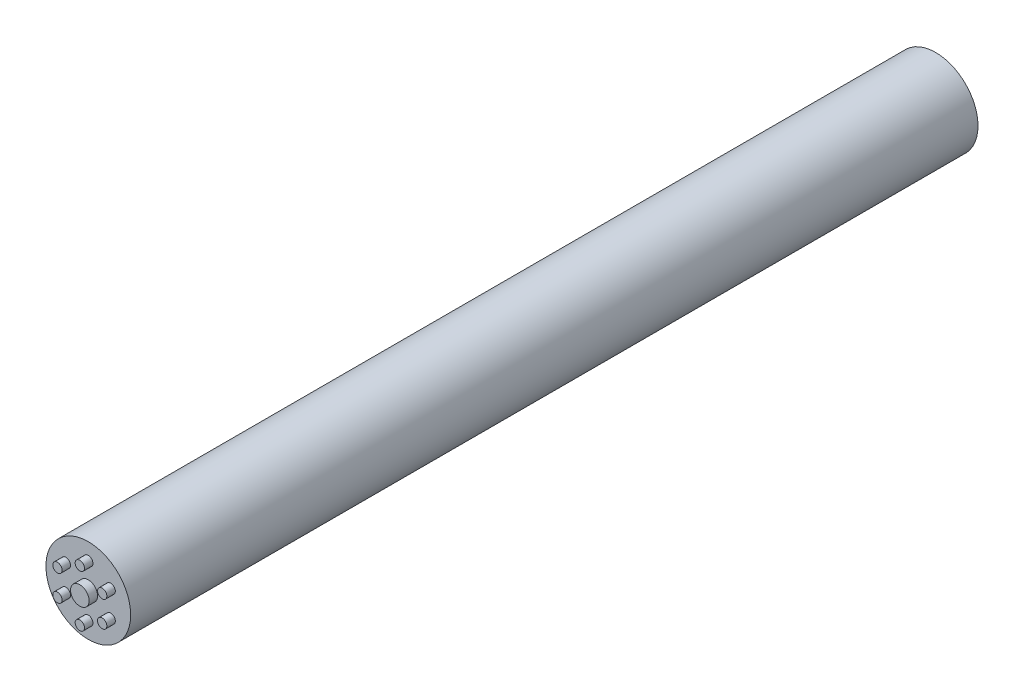
ISO-10303-21;
HEADER;
FILE_DESCRIPTION(('STEP AP214'),'2;1');
FILE_NAME('part.step','',(''),(''),'','','');
FILE_SCHEMA(('AUTOMOTIVE_DESIGN { 1 0 10303 214 1 1 1 1 }'));
ENDSEC;
DATA;
#1=APPLICATION_CONTEXT('core data for automotive mechanical design processes');
#2=APPLICATION_PROTOCOL_DEFINITION('international standard','automotive_design',2000,#1);
#3=PRODUCT_CONTEXT('',#1,'mechanical');
#4=PRODUCT('Part','Part','',(#3));
#5=PRODUCT_RELATED_PRODUCT_CATEGORY('part','',(#4));
#6=PRODUCT_DEFINITION_FORMATION('','',#4);
#7=PRODUCT_DEFINITION_CONTEXT('part definition',#1,'design');
#8=PRODUCT_DEFINITION('design','',#6,#7);
#9=PRODUCT_DEFINITION_SHAPE('','',#8);
#10=(LENGTH_UNIT() NAMED_UNIT(*) SI_UNIT(.MILLI.,.METRE.));
#11=(NAMED_UNIT(*) PLANE_ANGLE_UNIT() SI_UNIT($,.RADIAN.));
#12=(NAMED_UNIT(*) SI_UNIT($,.STERADIAN.) SOLID_ANGLE_UNIT());
#13=UNCERTAINTY_MEASURE_WITH_UNIT(LENGTH_MEASURE(1.E-05),#10,'distance_accuracy_value','');
#14=(GEOMETRIC_REPRESENTATION_CONTEXT(3) GLOBAL_UNCERTAINTY_ASSIGNED_CONTEXT((#13)) GLOBAL_UNIT_ASSIGNED_CONTEXT((#10,
#11,#12)) REPRESENTATION_CONTEXT('',''));
#15=CARTESIAN_POINT('',(0.,0.,0.));
#16=DIRECTION('',(0.,0.,1.));
#17=DIRECTION('',(1.,0.,0.));
#18=AXIS2_PLACEMENT_3D('',#15,#16,#17);
#19=CARTESIAN_POINT('',(0.,0.,100.));
#20=DIRECTION('',(0.,0.,-1.));
#21=DIRECTION('',(-1.,0.,0.));
#22=AXIS2_PLACEMENT_3D('',#19,#20,#21);
#23=CYLINDRICAL_SURFACE('',#22,5.);
#24=CARTESIAN_POINT('',(0.,0.,100.));
#25=DIRECTION('',(0.,0.,1.));
#26=DIRECTION('',(1.,0.,0.));
#27=AXIS2_PLACEMENT_3D('',#24,#25,#26);
#28=CIRCLE('',#27,5.);
#29=CARTESIAN_POINT('',(5.,0.,100.));
#30=VERTEX_POINT('',#29);
#31=EDGE_CURVE('E41',#30,#30,#28,.T.);
#32=ORIENTED_EDGE('',*,*,#31,.F.);
#33=EDGE_LOOP('',(#32));
#34=FACE_BOUND('',#33,.T.);
#35=CARTESIAN_POINT('',(0.,0.,0.));
#36=DIRECTION('',(0.,0.,1.));
#37=DIRECTION('',(1.,0.,0.));
#38=AXIS2_PLACEMENT_3D('',#35,#36,#37);
#39=CIRCLE('',#38,5.);
#40=CARTESIAN_POINT('',(5.,0.,0.));
#41=VERTEX_POINT('',#40);
#42=EDGE_CURVE('E37',#41,#41,#39,.T.);
#43=ORIENTED_EDGE('',*,*,#42,.T.);
#44=EDGE_LOOP('',(#43));
#45=FACE_BOUND('',#44,.T.);
#46=ADVANCED_FACE('F34',(#34,#45),#23,.T.);
#47=CARTESIAN_POINT('',(0.,0.,100.));
#48=DIRECTION('',(0.,0.,1.));
#49=DIRECTION('',(1.,0.,0.));
#50=AXIS2_PLACEMENT_3D('',#47,#48,#49);
#51=PLANE('',#50);
#52=CARTESIAN_POINT('',(0.,3.05097322315044,100.));
#53=DIRECTION('',(0.,0.,1.));
#54=DIRECTION('',(1.,0.,0.));
#55=AXIS2_PLACEMENT_3D('',#52,#53,#54);
#56=CIRCLE('',#55,0.55);
#57=CARTESIAN_POINT('',(0.55,3.05097322315044,100.));
#58=VERTEX_POINT('',#57);
#59=EDGE_CURVE('E78',#58,#58,#56,.T.);
#60=ORIENTED_EDGE('',*,*,#59,.F.);
#61=EDGE_LOOP('',(#60));
#62=FACE_BOUND('',#61,.T.);
#63=CARTESIAN_POINT('',(-2.64222031751437,1.52548661157521,100.));
#64=DIRECTION('',(0.,0.,1.));
#65=DIRECTION('',(1.,0.,0.));
#66=AXIS2_PLACEMENT_3D('',#63,#64,#65);
#67=CIRCLE('',#66,0.55);
#68=CARTESIAN_POINT('',(-2.09222031751437,1.52548661157521,100.));
#69=VERTEX_POINT('',#68);
#70=EDGE_CURVE('E72',#69,#69,#67,.T.);
#71=ORIENTED_EDGE('',*,*,#70,.F.);
#72=EDGE_LOOP('',(#71));
#73=FACE_BOUND('',#72,.T.);
#74=CARTESIAN_POINT('',(-2.64222031751436,-1.52548661157523,100.));
#75=DIRECTION('',(0.,0.,1.));
#76=DIRECTION('',(1.,0.,0.));
#77=AXIS2_PLACEMENT_3D('',#74,#75,#76);
#78=CIRCLE('',#77,0.55);
#79=CARTESIAN_POINT('',(-2.09222031751436,-1.52548661157523,100.));
#80=VERTEX_POINT('',#79);
#81=EDGE_CURVE('E66',#80,#80,#78,.T.);
#82=ORIENTED_EDGE('',*,*,#81,.F.);
#83=EDGE_LOOP('',(#82));
#84=FACE_BOUND('',#83,.T.);
#85=CARTESIAN_POINT('',(0.,-3.05097322315044,100.));
#86=DIRECTION('',(0.,0.,1.));
#87=DIRECTION('',(1.,0.,0.));
#88=AXIS2_PLACEMENT_3D('',#85,#86,#87);
#89=CIRCLE('',#88,0.55);
#90=CARTESIAN_POINT('',(0.550000000000021,-3.05097322315044,100.));
#91=VERTEX_POINT('',#90);
#92=EDGE_CURVE('E60',#91,#91,#89,.T.);
#93=ORIENTED_EDGE('',*,*,#92,.F.);
#94=EDGE_LOOP('',(#93));
#95=FACE_BOUND('',#94,.T.);
#96=CARTESIAN_POINT('',(2.64222031751438,-1.52548661157519,100.));
#97=DIRECTION('',(0.,0.,1.));
#98=DIRECTION('',(1.,0.,0.));
#99=AXIS2_PLACEMENT_3D('',#96,#97,#98);
#100=CIRCLE('',#99,0.55);
#101=CARTESIAN_POINT('',(3.19222031751438,-1.52548661157519,100.));
#102=VERTEX_POINT('',#101);
#103=EDGE_CURVE('E54',#102,#102,#100,.T.);
#104=ORIENTED_EDGE('',*,*,#103,.F.);
#105=EDGE_LOOP('',(#104));
#106=FACE_BOUND('',#105,.T.);
#107=CARTESIAN_POINT('',(2.64222031751435,1.52548661157525,100.));
#108=DIRECTION('',(0.,0.,1.));
#109=DIRECTION('',(1.,0.,0.));
#110=AXIS2_PLACEMENT_3D('',#107,#108,#109);
#111=CIRCLE('',#110,0.55);
#112=CARTESIAN_POINT('',(3.19222031751435,1.52548661157525,100.));
#113=VERTEX_POINT('',#112);
#114=EDGE_CURVE('E50',#113,#113,#111,.T.);
#115=ORIENTED_EDGE('',*,*,#114,.F.);
#116=EDGE_LOOP('',(#115));
#117=FACE_BOUND('',#116,.T.);
#118=CARTESIAN_POINT('',(0.,0.,100.));
#119=DIRECTION('',(0.,0.,1.));
#120=DIRECTION('',(1.,0.,0.));
#121=AXIS2_PLACEMENT_3D('',#118,#119,#120);
#122=CIRCLE('',#121,1.1);
#123=CARTESIAN_POINT('',(1.1,0.,100.));
#124=VERTEX_POINT('',#123);
#125=EDGE_CURVE('E10',#124,#124,#122,.T.);
#126=ORIENTED_EDGE('',*,*,#125,.F.);
#127=EDGE_LOOP('',(#126));
#128=FACE_BOUND('',#127,.T.);
#129=ORIENTED_EDGE('',*,*,#31,.T.);
#130=EDGE_LOOP('',(#129));
#131=FACE_BOUND('',#130,.T.);
#132=ADVANCED_FACE('F89',(#62,#73,#84,#95,#106,#117,#128,#131),#51,.T.);
#133=CARTESIAN_POINT('',(0.,0.,0.));
#134=DIRECTION('',(0.,0.,1.));
#135=DIRECTION('',(1.,0.,0.));
#136=AXIS2_PLACEMENT_3D('',#133,#134,#135);
#137=PLANE('',#136);
#138=ORIENTED_EDGE('',*,*,#42,.F.);
#139=EDGE_LOOP('',(#138));
#140=FACE_BOUND('',#139,.T.);
#141=ADVANCED_FACE('F92',(#140),#137,.F.);
#142=CARTESIAN_POINT('',(0.,0.,101.));
#143=DIRECTION('',(0.,0.,-1.));
#144=DIRECTION('',(-1.,0.,0.));
#145=AXIS2_PLACEMENT_3D('',#142,#143,#144);
#146=CYLINDRICAL_SURFACE('',#145,1.1);
#147=CARTESIAN_POINT('',(0.,0.,101.));
#148=DIRECTION('',(0.,0.,1.));
#149=DIRECTION('',(1.,0.,0.));
#150=AXIS2_PLACEMENT_3D('',#147,#148,#149);
#151=CIRCLE('',#150,1.1);
#152=CARTESIAN_POINT('',(1.1,0.,101.));
#153=VERTEX_POINT('',#152);
#154=EDGE_CURVE('E47',#153,#153,#151,.T.);
#155=ORIENTED_EDGE('',*,*,#154,.F.);
#156=EDGE_LOOP('',(#155));
#157=FACE_BOUND('',#156,.T.);
#158=ORIENTED_EDGE('',*,*,#125,.T.);
#159=EDGE_LOOP('',(#158));
#160=FACE_BOUND('',#159,.T.);
#161=ADVANCED_FACE('F113',(#157,#160),#146,.T.);
#162=CARTESIAN_POINT('',(0.,0.,101.));
#163=DIRECTION('',(0.,0.,1.));
#164=DIRECTION('',(1.,0.,0.));
#165=AXIS2_PLACEMENT_3D('',#162,#163,#164);
#166=PLANE('',#165);
#167=ORIENTED_EDGE('',*,*,#154,.T.);
#168=EDGE_LOOP('',(#167));
#169=FACE_BOUND('',#168,.T.);
#170=ADVANCED_FACE('F117',(#169),#166,.T.);
#171=CARTESIAN_POINT('',(2.64222031751435,1.52548661157525,101.));
#172=DIRECTION('',(0.,0.,-1.));
#173=DIRECTION('',(-1.,0.,0.));
#174=AXIS2_PLACEMENT_3D('',#171,#172,#173);
#175=CYLINDRICAL_SURFACE('',#174,0.55);
#176=CARTESIAN_POINT('',(2.64222031751435,1.52548661157525,101.));
#177=DIRECTION('',(0.,0.,1.));
#178=DIRECTION('',(1.,0.,0.));
#179=AXIS2_PLACEMENT_3D('',#176,#177,#178);
#180=CIRCLE('',#179,0.55);
#181=CARTESIAN_POINT('',(3.19222031751435,1.52548661157525,101.));
#182=VERTEX_POINT('',#181);
#183=EDGE_CURVE('E51',#182,#182,#180,.T.);
#184=ORIENTED_EDGE('',*,*,#183,.F.);
#185=EDGE_LOOP('',(#184));
#186=FACE_BOUND('',#185,.T.);
#187=ORIENTED_EDGE('',*,*,#114,.T.);
#188=EDGE_LOOP('',(#187));
#189=FACE_BOUND('',#188,.T.);
#190=ADVANCED_FACE('F123',(#186,#189),#175,.T.);
#191=CARTESIAN_POINT('',(2.64222031751435,1.52548661157525,101.));
#192=DIRECTION('',(0.,0.,1.));
#193=DIRECTION('',(1.,0.,0.));
#194=AXIS2_PLACEMENT_3D('',#191,#192,#193);
#195=PLANE('',#194);
#196=ORIENTED_EDGE('',*,*,#183,.T.);
#197=EDGE_LOOP('',(#196));
#198=FACE_BOUND('',#197,.T.);
#199=ADVANCED_FACE('F125',(#198),#195,.T.);
#200=CARTESIAN_POINT('',(2.64222031751438,-1.52548661157519,101.));
#201=DIRECTION('',(0.,0.,-1.));
#202=DIRECTION('',(-1.,0.,0.));
#203=AXIS2_PLACEMENT_3D('',#200,#201,#202);
#204=CYLINDRICAL_SURFACE('',#203,0.55);
#205=CARTESIAN_POINT('',(2.64222031751438,-1.52548661157519,101.));
#206=DIRECTION('',(0.,0.,1.));
#207=DIRECTION('',(1.,0.,0.));
#208=AXIS2_PLACEMENT_3D('',#205,#206,#207);
#209=CIRCLE('',#208,0.55);
#210=CARTESIAN_POINT('',(3.19222031751438,-1.52548661157519,101.));
#211=VERTEX_POINT('',#210);
#212=EDGE_CURVE('E57',#211,#211,#209,.T.);
#213=ORIENTED_EDGE('',*,*,#212,.F.);
#214=EDGE_LOOP('',(#213));
#215=FACE_BOUND('',#214,.T.);
#216=ORIENTED_EDGE('',*,*,#103,.T.);
#217=EDGE_LOOP('',(#216));
#218=FACE_BOUND('',#217,.T.);
#219=ADVANCED_FACE('F128',(#215,#218),#204,.T.);
#220=CARTESIAN_POINT('',(2.64222031751438,-1.52548661157519,101.));
#221=DIRECTION('',(0.,0.,1.));
#222=DIRECTION('',(1.,0.,0.));
#223=AXIS2_PLACEMENT_3D('',#220,#221,#222);
#224=PLANE('',#223);
#225=ORIENTED_EDGE('',*,*,#212,.T.);
#226=EDGE_LOOP('',(#225));
#227=FACE_BOUND('',#226,.T.);
#228=ADVANCED_FACE('F133',(#227),#224,.T.);
#229=CARTESIAN_POINT('',(0.,-3.05097322315044,101.));
#230=DIRECTION('',(0.,0.,-1.));
#231=DIRECTION('',(-1.,0.,0.));
#232=AXIS2_PLACEMENT_3D('',#229,#230,#231);
#233=CYLINDRICAL_SURFACE('',#232,0.55);
#234=CARTESIAN_POINT('',(0.,-3.05097322315044,101.));
#235=DIRECTION('',(0.,0.,1.));
#236=DIRECTION('',(1.,0.,0.));
#237=AXIS2_PLACEMENT_3D('',#234,#235,#236);
#238=CIRCLE('',#237,0.55);
#239=CARTESIAN_POINT('',(0.550000000000021,-3.05097322315044,101.));
#240=VERTEX_POINT('',#239);
#241=EDGE_CURVE('E63',#240,#240,#238,.T.);
#242=ORIENTED_EDGE('',*,*,#241,.F.);
#243=EDGE_LOOP('',(#242));
#244=FACE_BOUND('',#243,.T.);
#245=ORIENTED_EDGE('',*,*,#92,.T.);
#246=EDGE_LOOP('',(#245));
#247=FACE_BOUND('',#246,.T.);
#248=ADVANCED_FACE('F136',(#244,#247),#233,.T.);
#249=CARTESIAN_POINT('',(0.,-3.05097322315044,101.));
#250=DIRECTION('',(0.,0.,1.));
#251=DIRECTION('',(1.,0.,0.));
#252=AXIS2_PLACEMENT_3D('',#249,#250,#251);
#253=PLANE('',#252);
#254=ORIENTED_EDGE('',*,*,#241,.T.);
#255=EDGE_LOOP('',(#254));
#256=FACE_BOUND('',#255,.T.);
#257=ADVANCED_FACE('F141',(#256),#253,.T.);
#258=CARTESIAN_POINT('',(-2.64222031751436,-1.52548661157523,101.));
#259=DIRECTION('',(0.,0.,-1.));
#260=DIRECTION('',(-1.,0.,0.));
#261=AXIS2_PLACEMENT_3D('',#258,#259,#260);
#262=CYLINDRICAL_SURFACE('',#261,0.55);
#263=CARTESIAN_POINT('',(-2.64222031751436,-1.52548661157523,101.));
#264=DIRECTION('',(0.,0.,1.));
#265=DIRECTION('',(1.,0.,0.));
#266=AXIS2_PLACEMENT_3D('',#263,#264,#265);
#267=CIRCLE('',#266,0.55);
#268=CARTESIAN_POINT('',(-2.09222031751436,-1.52548661157523,101.));
#269=VERTEX_POINT('',#268);
#270=EDGE_CURVE('E69',#269,#269,#267,.T.);
#271=ORIENTED_EDGE('',*,*,#270,.F.);
#272=EDGE_LOOP('',(#271));
#273=FACE_BOUND('',#272,.T.);
#274=ORIENTED_EDGE('',*,*,#81,.T.);
#275=EDGE_LOOP('',(#274));
#276=FACE_BOUND('',#275,.T.);
#277=ADVANCED_FACE('F144',(#273,#276),#262,.T.);
#278=CARTESIAN_POINT('',(-2.64222031751436,-1.52548661157523,101.));
#279=DIRECTION('',(0.,0.,1.));
#280=DIRECTION('',(1.,0.,0.));
#281=AXIS2_PLACEMENT_3D('',#278,#279,#280);
#282=PLANE('',#281);
#283=ORIENTED_EDGE('',*,*,#270,.T.);
#284=EDGE_LOOP('',(#283));
#285=FACE_BOUND('',#284,.T.);
#286=ADVANCED_FACE('F149',(#285),#282,.T.);
#287=CARTESIAN_POINT('',(-2.64222031751437,1.52548661157521,101.));
#288=DIRECTION('',(0.,0.,-1.));
#289=DIRECTION('',(-1.,0.,0.));
#290=AXIS2_PLACEMENT_3D('',#287,#288,#289);
#291=CYLINDRICAL_SURFACE('',#290,0.55);
#292=CARTESIAN_POINT('',(-2.64222031751437,1.52548661157521,101.));
#293=DIRECTION('',(0.,0.,1.));
#294=DIRECTION('',(1.,0.,0.));
#295=AXIS2_PLACEMENT_3D('',#292,#293,#294);
#296=CIRCLE('',#295,0.55);
#297=CARTESIAN_POINT('',(-2.09222031751437,1.52548661157521,101.));
#298=VERTEX_POINT('',#297);
#299=EDGE_CURVE('E75',#298,#298,#296,.T.);
#300=ORIENTED_EDGE('',*,*,#299,.F.);
#301=EDGE_LOOP('',(#300));
#302=FACE_BOUND('',#301,.T.);
#303=ORIENTED_EDGE('',*,*,#70,.T.);
#304=EDGE_LOOP('',(#303));
#305=FACE_BOUND('',#304,.T.);
#306=ADVANCED_FACE('F152',(#302,#305),#291,.T.);
#307=CARTESIAN_POINT('',(-2.64222031751437,1.52548661157521,101.));
#308=DIRECTION('',(0.,0.,1.));
#309=DIRECTION('',(1.,0.,0.));
#310=AXIS2_PLACEMENT_3D('',#307,#308,#309);
#311=PLANE('',#310);
#312=ORIENTED_EDGE('',*,*,#299,.T.);
#313=EDGE_LOOP('',(#312));
#314=FACE_BOUND('',#313,.T.);
#315=ADVANCED_FACE('F157',(#314),#311,.T.);
#316=CARTESIAN_POINT('',(0.,3.05097322315044,101.));
#317=DIRECTION('',(0.,0.,-1.));
#318=DIRECTION('',(-1.,0.,0.));
#319=AXIS2_PLACEMENT_3D('',#316,#317,#318);
#320=CYLINDRICAL_SURFACE('',#319,0.55);
#321=CARTESIAN_POINT('',(0.,3.05097322315044,101.));
#322=DIRECTION('',(0.,0.,1.));
#323=DIRECTION('',(1.,0.,0.));
#324=AXIS2_PLACEMENT_3D('',#321,#322,#323);
#325=CIRCLE('',#324,0.55);
#326=CARTESIAN_POINT('',(0.55,3.05097322315044,101.));
#327=VERTEX_POINT('',#326);
#328=EDGE_CURVE('E81',#327,#327,#325,.T.);
#329=ORIENTED_EDGE('',*,*,#328,.F.);
#330=EDGE_LOOP('',(#329));
#331=FACE_BOUND('',#330,.T.);
#332=ORIENTED_EDGE('',*,*,#59,.T.);
#333=EDGE_LOOP('',(#332));
#334=FACE_BOUND('',#333,.T.);
#335=ADVANCED_FACE('F87',(#331,#334),#320,.T.);
#336=CARTESIAN_POINT('',(0.,3.05097322315044,101.));
#337=DIRECTION('',(0.,0.,1.));
#338=DIRECTION('',(1.,0.,0.));
#339=AXIS2_PLACEMENT_3D('',#336,#337,#338);
#340=PLANE('',#339);
#341=ORIENTED_EDGE('',*,*,#328,.T.);
#342=EDGE_LOOP('',(#341));
#343=FACE_BOUND('',#342,.T.);
#344=ADVANCED_FACE('F164',(#343),#340,.T.);
#345=CLOSED_SHELL('',(#46,#132,#141,#161,#170,#190,#199,#219,#228,#248,#257,#277,#286,#306,#315,
#335,#344));
#346=MANIFOLD_SOLID_BREP('B2',#345);
#347=ADVANCED_BREP_SHAPE_REPRESENTATION('',(#18,#346),#14);
#348=SHAPE_DEFINITION_REPRESENTATION(#9,#347);
ENDSEC;
END-ISO-10303-21;
